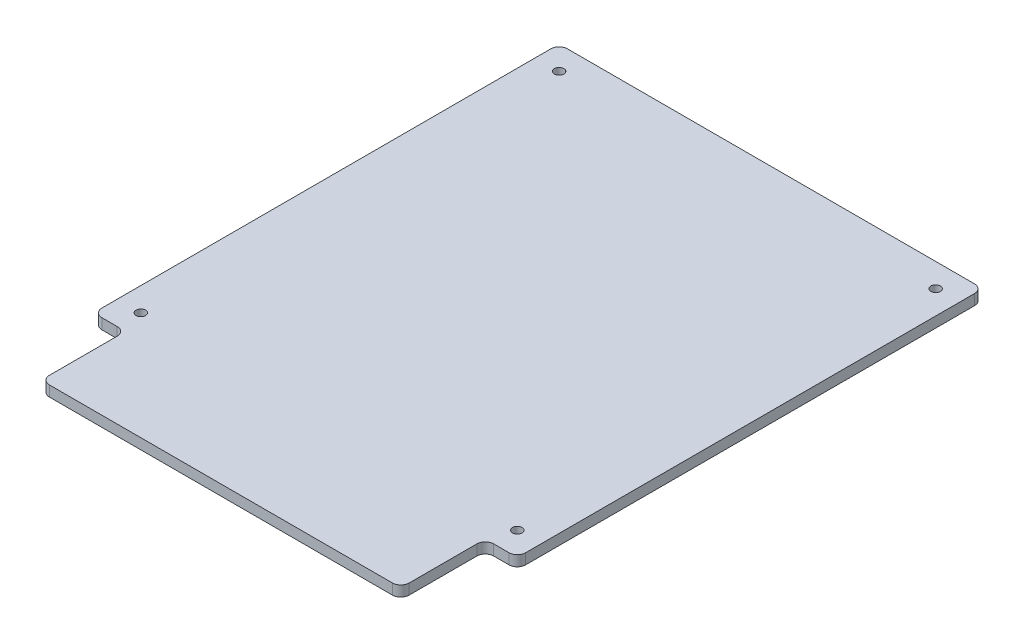
ISO-10303-21;
HEADER;
FILE_DESCRIPTION(('STEP AP214'),'2;1');
FILE_NAME('part.step','',(''),(''),'','','');
FILE_SCHEMA(('AUTOMOTIVE_DESIGN { 1 0 10303 214 1 1 1 1 }'));
ENDSEC;
DATA;
#1=APPLICATION_CONTEXT('core data for automotive mechanical design processes');
#2=APPLICATION_PROTOCOL_DEFINITION('international standard','automotive_design',2000,#1);
#3=PRODUCT_CONTEXT('',#1,'mechanical');
#4=PRODUCT('Part','Part','',(#3));
#5=PRODUCT_RELATED_PRODUCT_CATEGORY('part','',(#4));
#6=PRODUCT_DEFINITION_FORMATION('','',#4);
#7=PRODUCT_DEFINITION_CONTEXT('part definition',#1,'design');
#8=PRODUCT_DEFINITION('design','',#6,#7);
#9=PRODUCT_DEFINITION_SHAPE('','',#8);
#10=(LENGTH_UNIT() NAMED_UNIT(*) SI_UNIT(.MILLI.,.METRE.));
#11=(NAMED_UNIT(*) PLANE_ANGLE_UNIT() SI_UNIT($,.RADIAN.));
#12=(NAMED_UNIT(*) SI_UNIT($,.STERADIAN.) SOLID_ANGLE_UNIT());
#13=UNCERTAINTY_MEASURE_WITH_UNIT(LENGTH_MEASURE(1.E-05),#10,'distance_accuracy_value','');
#14=(GEOMETRIC_REPRESENTATION_CONTEXT(3) GLOBAL_UNCERTAINTY_ASSIGNED_CONTEXT((#13)) GLOBAL_UNIT_ASSIGNED_CONTEXT((#10,
#11,#12)) REPRESENTATION_CONTEXT('',''));
#15=CARTESIAN_POINT('',(0.,0.,0.));
#16=DIRECTION('',(0.,0.,1.));
#17=DIRECTION('',(1.,0.,0.));
#18=AXIS2_PLACEMENT_3D('',#15,#16,#17);
#19=CARTESIAN_POINT('',(0.,-9.525,-10.9073024484276));
#20=DIRECTION('',(0.,0.,-1.));
#21=DIRECTION('',(-1.,0.,0.));
#22=AXIS2_PLACEMENT_3D('',#19,#20,#21);
#23=PLANE('',#22);
#24=DIRECTION('',(-1.,0.,0.));
#25=VECTOR('',#24,1.);
#26=CARTESIAN_POINT('',(0.,-7.925,-10.9073024484276));
#27=LINE('',#26,#25);
#28=CARTESIAN_POINT('',(30.8971024484277,-7.925,-10.9073024484276));
#29=VERTEX_POINT('',#28);
#30=CARTESIAN_POINT('',(-30.8971024484276,-7.925,-10.9073024484276));
#31=VERTEX_POINT('',#30);
#32=EDGE_CURVE('E11',#29,#31,#27,.T.);
#33=ORIENTED_EDGE('',*,*,#32,.F.);
#34=DIRECTION('',(0.,1.,0.));
#35=VECTOR('',#34,1.);
#36=CARTESIAN_POINT('',(30.8971024484277,-9.525,-10.9073024484276));
#37=LINE('',#36,#35);
#38=CARTESIAN_POINT('',(30.8971024484277,-9.525,-10.9073024484276));
#39=VERTEX_POINT('',#38);
#40=EDGE_CURVE('E52',#39,#29,#37,.T.);
#41=ORIENTED_EDGE('',*,*,#40,.F.);
#42=DIRECTION('',(-1.,0.,0.));
#43=VECTOR('',#42,1.);
#44=CARTESIAN_POINT('',(0.,-9.525,-10.9073024484276));
#45=LINE('',#44,#43);
#46=CARTESIAN_POINT('',(-30.8971024484276,-9.525,-10.9073024484276));
#47=VERTEX_POINT('',#46);
#48=EDGE_CURVE('E296',#39,#47,#45,.T.);
#49=ORIENTED_EDGE('',*,*,#48,.T.);
#50=DIRECTION('',(0.,1.,0.));
#51=VECTOR('',#50,1.);
#52=CARTESIAN_POINT('',(-30.8971024484276,-9.525,-10.9073024484276));
#53=LINE('',#52,#51);
#54=EDGE_CURVE('E169',#47,#31,#53,.T.);
#55=ORIENTED_EDGE('',*,*,#54,.T.);
#56=EDGE_LOOP('',(#33,#41,#49,#55));
#57=FACE_BOUND('',#56,.T.);
#58=ADVANCED_FACE('F45',(#57),#23,.T.);
#59=CARTESIAN_POINT('',(30.8971024484277,-9.525,-9.63730244842763));
#60=DIRECTION('',(0.,1.,0.));
#61=DIRECTION('',(0.,0.,1.));
#62=AXIS2_PLACEMENT_3D('',#59,#60,#61);
#63=CYLINDRICAL_SURFACE('',#62,1.27000000000002);
#64=CARTESIAN_POINT('',(30.8971024484277,-7.925,-9.63730244842763));
#65=DIRECTION('',(0.,-1.,0.));
#66=DIRECTION('',(0.,0.,-1.));
#67=AXIS2_PLACEMENT_3D('',#64,#65,#66);
#68=CIRCLE('',#67,1.27000000000002);
#69=CARTESIAN_POINT('',(32.1671024484277,-7.925,-9.63730244842763));
#70=VERTEX_POINT('',#69);
#71=EDGE_CURVE('E293',#29,#70,#68,.T.);
#72=ORIENTED_EDGE('',*,*,#71,.T.);
#73=DIRECTION('',(0.,1.,0.));
#74=VECTOR('',#73,1.);
#75=CARTESIAN_POINT('',(32.1671024484277,-9.525,-9.63730244842763));
#76=LINE('',#75,#74);
#77=CARTESIAN_POINT('',(32.1671024484277,-9.525,-9.63730244842763));
#78=VERTEX_POINT('',#77);
#79=EDGE_CURVE('E290',#78,#70,#76,.T.);
#80=ORIENTED_EDGE('',*,*,#79,.F.);
#81=CARTESIAN_POINT('',(30.8971024484277,-9.525,-9.63730244842763));
#82=DIRECTION('',(0.,-1.,0.));
#83=DIRECTION('',(0.,0.,-1.));
#84=AXIS2_PLACEMENT_3D('',#81,#82,#83);
#85=CIRCLE('',#84,1.27000000000002);
#86=EDGE_CURVE('E287',#39,#78,#85,.T.);
#87=ORIENTED_EDGE('',*,*,#86,.F.);
#88=ORIENTED_EDGE('',*,*,#40,.T.);
#89=EDGE_LOOP('',(#72,#80,#87,#88));
#90=FACE_BOUND('',#89,.T.);
#91=ADVANCED_FACE('F299',(#90),#63,.T.);
#92=CARTESIAN_POINT('',(32.1671024484277,-9.525,24.4348));
#93=DIRECTION('',(1.,0.,0.));
#94=DIRECTION('',(0.,0.,-1.));
#95=AXIS2_PLACEMENT_3D('',#92,#93,#94);
#96=PLANE('',#95);
#97=DIRECTION('',(0.,0.,-1.));
#98=VECTOR('',#97,1.);
#99=CARTESIAN_POINT('',(32.1671024484277,-7.925,24.4348));
#100=LINE('',#99,#98);
#101=CARTESIAN_POINT('',(32.1671024484277,-7.925,58.5069024484277));
#102=VERTEX_POINT('',#101);
#103=EDGE_CURVE('E284',#102,#70,#100,.T.);
#104=ORIENTED_EDGE('',*,*,#103,.F.);
#105=DIRECTION('',(0.,1.,0.));
#106=VECTOR('',#105,1.);
#107=CARTESIAN_POINT('',(32.1671024484277,-9.525,58.5069024484277));
#108=LINE('',#107,#106);
#109=CARTESIAN_POINT('',(32.1671024484277,-9.525,58.5069024484277));
#110=VERTEX_POINT('',#109);
#111=EDGE_CURVE('E281',#110,#102,#108,.T.);
#112=ORIENTED_EDGE('',*,*,#111,.F.);
#113=DIRECTION('',(0.,0.,-1.));
#114=VECTOR('',#113,1.);
#115=CARTESIAN_POINT('',(32.1671024484277,-9.525,24.4348));
#116=LINE('',#115,#114);
#117=EDGE_CURVE('E278',#110,#78,#116,.T.);
#118=ORIENTED_EDGE('',*,*,#117,.T.);
#119=ORIENTED_EDGE('',*,*,#79,.T.);
#120=EDGE_LOOP('',(#104,#112,#118,#119));
#121=FACE_BOUND('',#120,.T.);
#122=ADVANCED_FACE('F304',(#121),#96,.T.);
#123=CARTESIAN_POINT('',(30.8971024484277,-9.525,58.5069024484277));
#124=DIRECTION('',(0.,1.,0.));
#125=DIRECTION('',(0.,0.,1.));
#126=AXIS2_PLACEMENT_3D('',#123,#124,#125);
#127=CYLINDRICAL_SURFACE('',#126,1.27);
#128=CARTESIAN_POINT('',(30.8971024484277,-7.925,58.5069024484277));
#129=DIRECTION('',(0.,-1.,0.));
#130=DIRECTION('',(0.,0.,-1.));
#131=AXIS2_PLACEMENT_3D('',#128,#129,#130);
#132=CIRCLE('',#131,1.27);
#133=CARTESIAN_POINT('',(30.8971024484277,-7.925,59.7769024484277));
#134=VERTEX_POINT('',#133);
#135=EDGE_CURVE('E276',#102,#134,#132,.T.);
#136=ORIENTED_EDGE('',*,*,#135,.T.);
#137=DIRECTION('',(0.,1.,0.));
#138=VECTOR('',#137,1.);
#139=CARTESIAN_POINT('',(30.8971024484277,-9.525,59.7769024484277));
#140=LINE('',#139,#138);
#141=CARTESIAN_POINT('',(30.8971024484277,-9.525,59.7769024484277));
#142=VERTEX_POINT('',#141);
#143=EDGE_CURVE('E273',#142,#134,#140,.T.);
#144=ORIENTED_EDGE('',*,*,#143,.F.);
#145=CARTESIAN_POINT('',(30.8971024484277,-9.525,58.5069024484277));
#146=DIRECTION('',(0.,-1.,0.));
#147=DIRECTION('',(0.,0.,-1.));
#148=AXIS2_PLACEMENT_3D('',#145,#146,#147);
#149=CIRCLE('',#148,1.27);
#150=EDGE_CURVE('E270',#110,#142,#149,.T.);
#151=ORIENTED_EDGE('',*,*,#150,.F.);
#152=ORIENTED_EDGE('',*,*,#111,.T.);
#153=EDGE_LOOP('',(#136,#144,#151,#152));
#154=FACE_BOUND('',#153,.T.);
#155=ADVANCED_FACE('F307',(#154),#127,.T.);
#156=CARTESIAN_POINT('',(29.7360512242138,-9.525,59.7769024484277));
#157=DIRECTION('',(0.,0.,1.));
#158=DIRECTION('',(1.,0.,0.));
#159=AXIS2_PLACEMENT_3D('',#156,#157,#158);
#160=PLANE('',#159);
#161=DIRECTION('',(1.,0.,0.));
#162=VECTOR('',#161,1.);
#163=CARTESIAN_POINT('',(29.7360512242138,-7.925,59.7769024484277));
#164=LINE('',#163,#162);
#165=CARTESIAN_POINT('',(28.575,-7.925,59.7769024484277));
#166=VERTEX_POINT('',#165);
#167=EDGE_CURVE('E267',#166,#134,#164,.T.);
#168=ORIENTED_EDGE('',*,*,#167,.F.);
#169=DIRECTION('',(0.,1.,0.));
#170=VECTOR('',#169,1.);
#171=CARTESIAN_POINT('',(28.575,-9.525,59.7769024484277));
#172=LINE('',#171,#170);
#173=CARTESIAN_POINT('',(28.575,-9.525,59.7769024484277));
#174=VERTEX_POINT('',#173);
#175=EDGE_CURVE('E264',#174,#166,#172,.T.);
#176=ORIENTED_EDGE('',*,*,#175,.F.);
#177=DIRECTION('',(1.,0.,0.));
#178=VECTOR('',#177,1.);
#179=CARTESIAN_POINT('',(29.7360512242138,-9.525,59.7769024484277));
#180=LINE('',#179,#178);
#181=EDGE_CURVE('E261',#174,#142,#180,.T.);
#182=ORIENTED_EDGE('',*,*,#181,.T.);
#183=ORIENTED_EDGE('',*,*,#143,.T.);
#184=EDGE_LOOP('',(#168,#176,#182,#183));
#185=FACE_BOUND('',#184,.T.);
#186=ADVANCED_FACE('F358',(#185),#160,.T.);
#187=CARTESIAN_POINT('',(28.575,-9.525,61.0469024484277));
#188=DIRECTION('',(0.,1.,0.));
#189=DIRECTION('',(0.,0.,1.));
#190=AXIS2_PLACEMENT_3D('',#187,#188,#189);
#191=CYLINDRICAL_SURFACE('',#190,1.27);
#192=CARTESIAN_POINT('',(28.575,-7.925,61.0469024484277));
#193=DIRECTION('',(0.,-1.,0.));
#194=DIRECTION('',(0.,0.,-1.));
#195=AXIS2_PLACEMENT_3D('',#192,#193,#194);
#196=CIRCLE('',#195,1.27);
#197=CARTESIAN_POINT('',(27.305,-7.925,61.0469024484277));
#198=VERTEX_POINT('',#197);
#199=EDGE_CURVE('E258',#198,#166,#196,.T.);
#200=ORIENTED_EDGE('',*,*,#199,.F.);
#201=DIRECTION('',(0.,1.,0.));
#202=VECTOR('',#201,1.);
#203=CARTESIAN_POINT('',(27.305,-9.525,61.0469024484277));
#204=LINE('',#203,#202);
#205=CARTESIAN_POINT('',(27.305,-9.525,61.0469024484277));
#206=VERTEX_POINT('',#205);
#207=EDGE_CURVE('E255',#206,#198,#204,.T.);
#208=ORIENTED_EDGE('',*,*,#207,.F.);
#209=CARTESIAN_POINT('',(28.575,-9.525,61.0469024484277));
#210=DIRECTION('',(0.,-1.,0.));
#211=DIRECTION('',(0.,0.,-1.));
#212=AXIS2_PLACEMENT_3D('',#209,#210,#211);
#213=CIRCLE('',#212,1.27);
#214=EDGE_CURVE('E252',#206,#174,#213,.T.);
#215=ORIENTED_EDGE('',*,*,#214,.T.);
#216=ORIENTED_EDGE('',*,*,#175,.T.);
#217=EDGE_LOOP('',(#200,#208,#215,#216));
#218=FACE_BOUND('',#217,.T.);
#219=ADVANCED_FACE('F361',(#218),#191,.F.);
#220=CARTESIAN_POINT('',(27.305,-9.525,66.1890512242138));
#221=DIRECTION('',(1.,0.,0.));
#222=DIRECTION('',(0.,0.,-1.));
#223=AXIS2_PLACEMENT_3D('',#220,#221,#222);
#224=PLANE('',#223);
#225=DIRECTION('',(0.,0.,-1.));
#226=VECTOR('',#225,1.);
#227=CARTESIAN_POINT('',(27.305,-7.925,66.1890512242138));
#228=LINE('',#227,#226);
#229=CARTESIAN_POINT('',(27.305,-7.925,71.3312));
#230=VERTEX_POINT('',#229);
#231=EDGE_CURVE('E249',#230,#198,#228,.T.);
#232=ORIENTED_EDGE('',*,*,#231,.F.);
#233=DIRECTION('',(0.,1.,0.));
#234=VECTOR('',#233,1.);
#235=CARTESIAN_POINT('',(27.305,-9.525,71.3312));
#236=LINE('',#235,#234);
#237=CARTESIAN_POINT('',(27.305,-9.525,71.3312));
#238=VERTEX_POINT('',#237);
#239=EDGE_CURVE('E246',#238,#230,#236,.T.);
#240=ORIENTED_EDGE('',*,*,#239,.F.);
#241=DIRECTION('',(0.,0.,-1.));
#242=VECTOR('',#241,1.);
#243=CARTESIAN_POINT('',(27.305,-9.525,66.1890512242138));
#244=LINE('',#243,#242);
#245=EDGE_CURVE('E243',#238,#206,#244,.T.);
#246=ORIENTED_EDGE('',*,*,#245,.T.);
#247=ORIENTED_EDGE('',*,*,#207,.T.);
#248=EDGE_LOOP('',(#232,#240,#246,#247));
#249=FACE_BOUND('',#248,.T.);
#250=ADVANCED_FACE('F365',(#249),#224,.T.);
#251=CARTESIAN_POINT('',(26.035,-9.525,71.3312));
#252=DIRECTION('',(0.,1.,0.));
#253=DIRECTION('',(0.,0.,1.));
#254=AXIS2_PLACEMENT_3D('',#251,#252,#253);
#255=CYLINDRICAL_SURFACE('',#254,1.27);
#256=CARTESIAN_POINT('',(26.035,-7.925,71.3312));
#257=DIRECTION('',(0.,-1.,0.));
#258=DIRECTION('',(0.,0.,-1.));
#259=AXIS2_PLACEMENT_3D('',#256,#257,#258);
#260=CIRCLE('',#259,1.27);
#261=CARTESIAN_POINT('',(26.035,-7.925,72.6012));
#262=VERTEX_POINT('',#261);
#263=EDGE_CURVE('E241',#230,#262,#260,.T.);
#264=ORIENTED_EDGE('',*,*,#263,.T.);
#265=DIRECTION('',(0.,1.,0.));
#266=VECTOR('',#265,1.);
#267=CARTESIAN_POINT('',(26.035,-9.525,72.6012));
#268=LINE('',#267,#266);
#269=CARTESIAN_POINT('',(26.035,-9.525,72.6012));
#270=VERTEX_POINT('',#269);
#271=EDGE_CURVE('E238',#270,#262,#268,.T.);
#272=ORIENTED_EDGE('',*,*,#271,.F.);
#273=CARTESIAN_POINT('',(26.035,-9.525,71.3312));
#274=DIRECTION('',(0.,-1.,0.));
#275=DIRECTION('',(0.,0.,-1.));
#276=AXIS2_PLACEMENT_3D('',#273,#274,#275);
#277=CIRCLE('',#276,1.27);
#278=EDGE_CURVE('E235',#238,#270,#277,.T.);
#279=ORIENTED_EDGE('',*,*,#278,.F.);
#280=ORIENTED_EDGE('',*,*,#239,.T.);
#281=EDGE_LOOP('',(#264,#272,#279,#280));
#282=FACE_BOUND('',#281,.T.);
#283=ADVANCED_FACE('F369',(#282),#255,.T.);
#284=CARTESIAN_POINT('',(0.,-9.525,72.6012));
#285=DIRECTION('',(0.,0.,1.));
#286=DIRECTION('',(1.,0.,0.));
#287=AXIS2_PLACEMENT_3D('',#284,#285,#286);
#288=PLANE('',#287);
#289=DIRECTION('',(1.,0.,0.));
#290=VECTOR('',#289,1.);
#291=CARTESIAN_POINT('',(0.,-7.925,72.6012));
#292=LINE('',#291,#290);
#293=CARTESIAN_POINT('',(-26.035,-7.925,72.6012));
#294=VERTEX_POINT('',#293);
#295=EDGE_CURVE('E232',#294,#262,#292,.T.);
#296=ORIENTED_EDGE('',*,*,#295,.F.);
#297=DIRECTION('',(0.,1.,0.));
#298=VECTOR('',#297,1.);
#299=CARTESIAN_POINT('',(-26.035,-9.525,72.6012));
#300=LINE('',#299,#298);
#301=CARTESIAN_POINT('',(-26.035,-9.525,72.6012));
#302=VERTEX_POINT('',#301);
#303=EDGE_CURVE('E229',#302,#294,#300,.T.);
#304=ORIENTED_EDGE('',*,*,#303,.F.);
#305=DIRECTION('',(1.,0.,0.));
#306=VECTOR('',#305,1.);
#307=CARTESIAN_POINT('',(0.,-9.525,72.6012));
#308=LINE('',#307,#306);
#309=EDGE_CURVE('E226',#302,#270,#308,.T.);
#310=ORIENTED_EDGE('',*,*,#309,.T.);
#311=ORIENTED_EDGE('',*,*,#271,.T.);
#312=EDGE_LOOP('',(#296,#304,#310,#311));
#313=FACE_BOUND('',#312,.T.);
#314=ADVANCED_FACE('F373',(#313),#288,.T.);
#315=CARTESIAN_POINT('',(-26.035,-9.525,71.3312));
#316=DIRECTION('',(0.,1.,0.));
#317=DIRECTION('',(0.,0.,1.));
#318=AXIS2_PLACEMENT_3D('',#315,#316,#317);
#319=CYLINDRICAL_SURFACE('',#318,1.27);
#320=CARTESIAN_POINT('',(-26.035,-7.925,71.3312));
#321=DIRECTION('',(0.,-1.,0.));
#322=DIRECTION('',(0.,0.,-1.));
#323=AXIS2_PLACEMENT_3D('',#320,#321,#322);
#324=CIRCLE('',#323,1.27);
#325=CARTESIAN_POINT('',(-27.305,-7.925,71.3312));
#326=VERTEX_POINT('',#325);
#327=EDGE_CURVE('E224',#294,#326,#324,.T.);
#328=ORIENTED_EDGE('',*,*,#327,.T.);
#329=DIRECTION('',(0.,1.,0.));
#330=VECTOR('',#329,1.);
#331=CARTESIAN_POINT('',(-27.305,-9.525,71.3312));
#332=LINE('',#331,#330);
#333=CARTESIAN_POINT('',(-27.305,-9.525,71.3312));
#334=VERTEX_POINT('',#333);
#335=EDGE_CURVE('E221',#334,#326,#332,.T.);
#336=ORIENTED_EDGE('',*,*,#335,.F.);
#337=CARTESIAN_POINT('',(-26.035,-9.525,71.3312));
#338=DIRECTION('',(0.,-1.,0.));
#339=DIRECTION('',(0.,0.,-1.));
#340=AXIS2_PLACEMENT_3D('',#337,#338,#339);
#341=CIRCLE('',#340,1.27);
#342=EDGE_CURVE('E218',#302,#334,#341,.T.);
#343=ORIENTED_EDGE('',*,*,#342,.F.);
#344=ORIENTED_EDGE('',*,*,#303,.T.);
#345=EDGE_LOOP('',(#328,#336,#343,#344));
#346=FACE_BOUND('',#345,.T.);
#347=ADVANCED_FACE('F377',(#346),#319,.T.);
#348=CARTESIAN_POINT('',(-27.305,-9.525,66.1890512242138));
#349=DIRECTION('',(-1.,0.,0.));
#350=DIRECTION('',(0.,0.,1.));
#351=AXIS2_PLACEMENT_3D('',#348,#349,#350);
#352=PLANE('',#351);
#353=DIRECTION('',(0.,0.,1.));
#354=VECTOR('',#353,1.);
#355=CARTESIAN_POINT('',(-27.305,-7.925,66.1890512242138));
#356=LINE('',#355,#354);
#357=CARTESIAN_POINT('',(-27.305,-7.925,61.0469024484277));
#358=VERTEX_POINT('',#357);
#359=EDGE_CURVE('E215',#358,#326,#356,.T.);
#360=ORIENTED_EDGE('',*,*,#359,.F.);
#361=DIRECTION('',(0.,1.,0.));
#362=VECTOR('',#361,1.);
#363=CARTESIAN_POINT('',(-27.305,-9.525,61.0469024484277));
#364=LINE('',#363,#362);
#365=CARTESIAN_POINT('',(-27.305,-9.525,61.0469024484277));
#366=VERTEX_POINT('',#365);
#367=EDGE_CURVE('E212',#366,#358,#364,.T.);
#368=ORIENTED_EDGE('',*,*,#367,.F.);
#369=DIRECTION('',(0.,0.,1.));
#370=VECTOR('',#369,1.);
#371=CARTESIAN_POINT('',(-27.305,-9.525,66.1890512242138));
#372=LINE('',#371,#370);
#373=EDGE_CURVE('E209',#366,#334,#372,.T.);
#374=ORIENTED_EDGE('',*,*,#373,.T.);
#375=ORIENTED_EDGE('',*,*,#335,.T.);
#376=EDGE_LOOP('',(#360,#368,#374,#375));
#377=FACE_BOUND('',#376,.T.);
#378=ADVANCED_FACE('F381',(#377),#352,.T.);
#379=CARTESIAN_POINT('',(-28.575,-9.525,61.0469024484277));
#380=DIRECTION('',(0.,1.,0.));
#381=DIRECTION('',(0.,0.,1.));
#382=AXIS2_PLACEMENT_3D('',#379,#380,#381);
#383=CYLINDRICAL_SURFACE('',#382,1.27);
#384=CARTESIAN_POINT('',(-28.575,-7.925,61.0469024484277));
#385=DIRECTION('',(0.,-1.,0.));
#386=DIRECTION('',(0.,0.,-1.));
#387=AXIS2_PLACEMENT_3D('',#384,#385,#386);
#388=CIRCLE('',#387,1.27);
#389=CARTESIAN_POINT('',(-28.575,-7.925,59.7769024484277));
#390=VERTEX_POINT('',#389);
#391=EDGE_CURVE('E206',#390,#358,#388,.T.);
#392=ORIENTED_EDGE('',*,*,#391,.F.);
#393=DIRECTION('',(0.,1.,0.));
#394=VECTOR('',#393,1.);
#395=CARTESIAN_POINT('',(-28.575,-9.525,59.7769024484277));
#396=LINE('',#395,#394);
#397=CARTESIAN_POINT('',(-28.575,-9.525,59.7769024484277));
#398=VERTEX_POINT('',#397);
#399=EDGE_CURVE('E203',#398,#390,#396,.T.);
#400=ORIENTED_EDGE('',*,*,#399,.F.);
#401=CARTESIAN_POINT('',(-28.575,-9.525,61.0469024484277));
#402=DIRECTION('',(0.,-1.,0.));
#403=DIRECTION('',(0.,0.,-1.));
#404=AXIS2_PLACEMENT_3D('',#401,#402,#403);
#405=CIRCLE('',#404,1.27);
#406=EDGE_CURVE('E200',#398,#366,#405,.T.);
#407=ORIENTED_EDGE('',*,*,#406,.T.);
#408=ORIENTED_EDGE('',*,*,#367,.T.);
#409=EDGE_LOOP('',(#392,#400,#407,#408));
#410=FACE_BOUND('',#409,.T.);
#411=ADVANCED_FACE('F385',(#410),#383,.F.);
#412=CARTESIAN_POINT('',(-29.7360512242138,-9.525,59.7769024484277));
#413=DIRECTION('',(0.,0.,1.));
#414=DIRECTION('',(1.,0.,0.));
#415=AXIS2_PLACEMENT_3D('',#412,#413,#414);
#416=PLANE('',#415);
#417=DIRECTION('',(1.,0.,0.));
#418=VECTOR('',#417,1.);
#419=CARTESIAN_POINT('',(-29.7360512242138,-7.925,59.7769024484277));
#420=LINE('',#419,#418);
#421=CARTESIAN_POINT('',(-30.8971024484276,-7.925,59.7769024484277));
#422=VERTEX_POINT('',#421);
#423=EDGE_CURVE('E197',#422,#390,#420,.T.);
#424=ORIENTED_EDGE('',*,*,#423,.F.);
#425=DIRECTION('',(0.,1.,0.));
#426=VECTOR('',#425,1.);
#427=CARTESIAN_POINT('',(-30.8971024484276,-9.525,59.7769024484277));
#428=LINE('',#427,#426);
#429=CARTESIAN_POINT('',(-30.8971024484276,-9.525,59.7769024484277));
#430=VERTEX_POINT('',#429);
#431=EDGE_CURVE('E194',#430,#422,#428,.T.);
#432=ORIENTED_EDGE('',*,*,#431,.F.);
#433=DIRECTION('',(1.,0.,0.));
#434=VECTOR('',#433,1.);
#435=CARTESIAN_POINT('',(-29.7360512242138,-9.525,59.7769024484277));
#436=LINE('',#435,#434);
#437=EDGE_CURVE('E191',#430,#398,#436,.T.);
#438=ORIENTED_EDGE('',*,*,#437,.T.);
#439=ORIENTED_EDGE('',*,*,#399,.T.);
#440=EDGE_LOOP('',(#424,#432,#438,#439));
#441=FACE_BOUND('',#440,.T.);
#442=ADVANCED_FACE('F389',(#441),#416,.T.);
#443=CARTESIAN_POINT('',(-30.8971024484276,-9.525,58.5069024484277));
#444=DIRECTION('',(0.,1.,0.));
#445=DIRECTION('',(0.,0.,1.));
#446=AXIS2_PLACEMENT_3D('',#443,#444,#445);
#447=CYLINDRICAL_SURFACE('',#446,1.27000000000001);
#448=CARTESIAN_POINT('',(-30.8971024484276,-7.925,58.5069024484277));
#449=DIRECTION('',(0.,-1.,0.));
#450=DIRECTION('',(0.,0.,-1.));
#451=AXIS2_PLACEMENT_3D('',#448,#449,#450);
#452=CIRCLE('',#451,1.27000000000001);
#453=CARTESIAN_POINT('',(-32.1671024484277,-7.925,58.5069024484277));
#454=VERTEX_POINT('',#453);
#455=EDGE_CURVE('E189',#422,#454,#452,.T.);
#456=ORIENTED_EDGE('',*,*,#455,.T.);
#457=DIRECTION('',(0.,1.,0.));
#458=VECTOR('',#457,1.);
#459=CARTESIAN_POINT('',(-32.1671024484277,-9.525,58.5069024484277));
#460=LINE('',#459,#458);
#461=CARTESIAN_POINT('',(-32.1671024484277,-9.525,58.5069024484277));
#462=VERTEX_POINT('',#461);
#463=EDGE_CURVE('E187',#462,#454,#460,.T.);
#464=ORIENTED_EDGE('',*,*,#463,.F.);
#465=CARTESIAN_POINT('',(-30.8971024484276,-9.525,58.5069024484277));
#466=DIRECTION('',(0.,-1.,0.));
#467=DIRECTION('',(0.,0.,-1.));
#468=AXIS2_PLACEMENT_3D('',#465,#466,#467);
#469=CIRCLE('',#468,1.27000000000001);
#470=EDGE_CURVE('E177',#430,#462,#469,.T.);
#471=ORIENTED_EDGE('',*,*,#470,.F.);
#472=ORIENTED_EDGE('',*,*,#431,.T.);
#473=EDGE_LOOP('',(#456,#464,#471,#472));
#474=FACE_BOUND('',#473,.T.);
#475=ADVANCED_FACE('F345',(#474),#447,.T.);
#476=CARTESIAN_POINT('',(-32.1671024484276,-9.525,24.4348));
#477=DIRECTION('',(1.,0.,0.));
#478=DIRECTION('',(0.,0.,-1.));
#479=AXIS2_PLACEMENT_3D('',#476,#477,#478);
#480=PLANE('',#479);
#481=DIRECTION('',(0.,0.,-1.));
#482=VECTOR('',#481,1.);
#483=CARTESIAN_POINT('',(-32.1671024484276,-7.925,24.4348));
#484=LINE('',#483,#482);
#485=CARTESIAN_POINT('',(-32.1671024484276,-7.925,-9.63730244842763));
#486=VERTEX_POINT('',#485);
#487=EDGE_CURVE('E160',#454,#486,#484,.T.);
#488=ORIENTED_EDGE('',*,*,#487,.T.);
#489=DIRECTION('',(0.,1.,0.));
#490=VECTOR('',#489,1.);
#491=CARTESIAN_POINT('',(-32.1671024484276,-9.525,-9.63730244842763));
#492=LINE('',#491,#490);
#493=CARTESIAN_POINT('',(-32.1671024484276,-9.525,-9.63730244842763));
#494=VERTEX_POINT('',#493);
#495=EDGE_CURVE('E152',#494,#486,#492,.T.);
#496=ORIENTED_EDGE('',*,*,#495,.F.);
#497=DIRECTION('',(0.,0.,-1.));
#498=VECTOR('',#497,1.);
#499=CARTESIAN_POINT('',(-32.1671024484276,-9.525,24.4348));
#500=LINE('',#499,#498);
#501=EDGE_CURVE('E157',#462,#494,#500,.T.);
#502=ORIENTED_EDGE('',*,*,#501,.F.);
#503=ORIENTED_EDGE('',*,*,#463,.T.);
#504=EDGE_LOOP('',(#488,#496,#502,#503));
#505=FACE_BOUND('',#504,.T.);
#506=ADVANCED_FACE('F154',(#505),#480,.F.);
#507=CARTESIAN_POINT('',(28.575,-9.525,-7.3152));
#508=DIRECTION('',(0.,1.,0.));
#509=DIRECTION('',(0.,0.,1.));
#510=AXIS2_PLACEMENT_3D('',#507,#508,#509);
#511=CYLINDRICAL_SURFACE('',#510,0.725);
#512=CARTESIAN_POINT('',(28.575,-9.525,-7.3152));
#513=DIRECTION('',(0.,-1.,0.));
#514=DIRECTION('',(0.,0.,-1.));
#515=AXIS2_PLACEMENT_3D('',#512,#513,#514);
#516=CIRCLE('',#515,0.725);
#517=CARTESIAN_POINT('',(28.575,-9.525,-8.0402));
#518=VERTEX_POINT('',#517);
#519=EDGE_CURVE('E178',#518,#518,#516,.T.);
#520=ORIENTED_EDGE('',*,*,#519,.T.);
#521=EDGE_LOOP('',(#520));
#522=FACE_BOUND('',#521,.T.);
#523=CARTESIAN_POINT('',(28.575,-7.925,-7.3152));
#524=DIRECTION('',(0.,-1.,0.));
#525=DIRECTION('',(0.,0.,-1.));
#526=AXIS2_PLACEMENT_3D('',#523,#524,#525);
#527=CIRCLE('',#526,0.725);
#528=CARTESIAN_POINT('',(28.575,-7.925,-8.0402));
#529=VERTEX_POINT('',#528);
#530=EDGE_CURVE('E181',#529,#529,#527,.T.);
#531=ORIENTED_EDGE('',*,*,#530,.F.);
#532=EDGE_LOOP('',(#531));
#533=FACE_BOUND('',#532,.T.);
#534=ADVANCED_FACE('F333',(#522,#533),#511,.F.);
#535=CARTESIAN_POINT('',(28.575,-9.525,56.1848));
#536=DIRECTION('',(0.,1.,0.));
#537=DIRECTION('',(0.,0.,1.));
#538=AXIS2_PLACEMENT_3D('',#535,#536,#537);
#539=CYLINDRICAL_SURFACE('',#538,0.725);
#540=CARTESIAN_POINT('',(28.575,-9.525,56.1848));
#541=DIRECTION('',(0.,-1.,0.));
#542=DIRECTION('',(0.,0.,-1.));
#543=AXIS2_PLACEMENT_3D('',#540,#541,#542);
#544=CIRCLE('',#543,0.725);
#545=CARTESIAN_POINT('',(28.575,-9.525,55.4598));
#546=VERTEX_POINT('',#545);
#547=EDGE_CURVE('E327',#546,#546,#544,.T.);
#548=ORIENTED_EDGE('',*,*,#547,.T.);
#549=EDGE_LOOP('',(#548));
#550=FACE_BOUND('',#549,.T.);
#551=CARTESIAN_POINT('',(28.575,-7.925,56.1848));
#552=DIRECTION('',(0.,-1.,0.));
#553=DIRECTION('',(0.,0.,-1.));
#554=AXIS2_PLACEMENT_3D('',#551,#552,#553);
#555=CIRCLE('',#554,0.725);
#556=CARTESIAN_POINT('',(28.575,-7.925,55.4598));
#557=VERTEX_POINT('',#556);
#558=EDGE_CURVE('E324',#557,#557,#555,.T.);
#559=ORIENTED_EDGE('',*,*,#558,.F.);
#560=EDGE_LOOP('',(#559));
#561=FACE_BOUND('',#560,.T.);
#562=ADVANCED_FACE('F335',(#550,#561),#539,.F.);
#563=CARTESIAN_POINT('',(-28.575,-9.525,56.1848));
#564=DIRECTION('',(0.,1.,0.));
#565=DIRECTION('',(0.,0.,1.));
#566=AXIS2_PLACEMENT_3D('',#563,#564,#565);
#567=CYLINDRICAL_SURFACE('',#566,0.725);
#568=CARTESIAN_POINT('',(-28.575,-9.525,56.1848));
#569=DIRECTION('',(0.,-1.,0.));
#570=DIRECTION('',(0.,0.,-1.));
#571=AXIS2_PLACEMENT_3D('',#568,#569,#570);
#572=CIRCLE('',#571,0.725);
#573=CARTESIAN_POINT('',(-28.575,-9.525,55.4598));
#574=VERTEX_POINT('',#573);
#575=EDGE_CURVE('E321',#574,#574,#572,.T.);
#576=ORIENTED_EDGE('',*,*,#575,.T.);
#577=EDGE_LOOP('',(#576));
#578=FACE_BOUND('',#577,.T.);
#579=CARTESIAN_POINT('',(-28.575,-7.925,56.1848));
#580=DIRECTION('',(0.,-1.,0.));
#581=DIRECTION('',(0.,0.,-1.));
#582=AXIS2_PLACEMENT_3D('',#579,#580,#581);
#583=CIRCLE('',#582,0.725);
#584=CARTESIAN_POINT('',(-28.575,-7.925,55.4598));
#585=VERTEX_POINT('',#584);
#586=EDGE_CURVE('E318',#585,#585,#583,.T.);
#587=ORIENTED_EDGE('',*,*,#586,.F.);
#588=EDGE_LOOP('',(#587));
#589=FACE_BOUND('',#588,.T.);
#590=ADVANCED_FACE('F342',(#578,#589),#567,.F.);
#591=CARTESIAN_POINT('',(-28.575,-9.525,-7.3152));
#592=DIRECTION('',(0.,1.,0.));
#593=DIRECTION('',(0.,0.,1.));
#594=AXIS2_PLACEMENT_3D('',#591,#592,#593);
#595=CYLINDRICAL_SURFACE('',#594,0.725);
#596=CARTESIAN_POINT('',(-28.575,-9.525,-7.3152));
#597=DIRECTION('',(0.,-1.,0.));
#598=DIRECTION('',(0.,0.,-1.));
#599=AXIS2_PLACEMENT_3D('',#596,#597,#598);
#600=CIRCLE('',#599,0.725);
#601=CARTESIAN_POINT('',(-28.575,-9.525,-8.0402));
#602=VERTEX_POINT('',#601);
#603=EDGE_CURVE('E313',#602,#602,#600,.T.);
#604=ORIENTED_EDGE('',*,*,#603,.T.);
#605=EDGE_LOOP('',(#604));
#606=FACE_BOUND('',#605,.T.);
#607=CARTESIAN_POINT('',(-28.575,-7.925,-7.3152));
#608=DIRECTION('',(0.,-1.,0.));
#609=DIRECTION('',(0.,0.,-1.));
#610=AXIS2_PLACEMENT_3D('',#607,#608,#609);
#611=CIRCLE('',#610,0.725);
#612=CARTESIAN_POINT('',(-28.575,-7.925,-8.0402));
#613=VERTEX_POINT('',#612);
#614=EDGE_CURVE('E310',#613,#613,#611,.T.);
#615=ORIENTED_EDGE('',*,*,#614,.F.);
#616=EDGE_LOOP('',(#615));
#617=FACE_BOUND('',#616,.T.);
#618=ADVANCED_FACE('F438',(#606,#617),#595,.F.);
#619=CARTESIAN_POINT('',(-30.8971024484276,-9.525,-9.63730244842763));
#620=DIRECTION('',(0.,1.,0.));
#621=DIRECTION('',(0.,0.,1.));
#622=AXIS2_PLACEMENT_3D('',#619,#620,#621);
#623=CYLINDRICAL_SURFACE('',#622,1.27000000000002);
#624=CARTESIAN_POINT('',(-30.8971024484276,-7.925,-9.63730244842763));
#625=DIRECTION('',(0.,-1.,0.));
#626=DIRECTION('',(0.,0.,-1.));
#627=AXIS2_PLACEMENT_3D('',#624,#625,#626);
#628=CIRCLE('',#627,1.27000000000002);
#629=EDGE_CURVE('E172',#486,#31,#628,.T.);
#630=ORIENTED_EDGE('',*,*,#629,.T.);
#631=ORIENTED_EDGE('',*,*,#54,.F.);
#632=CARTESIAN_POINT('',(-30.8971024484276,-9.525,-9.63730244842763));
#633=DIRECTION('',(0.,-1.,0.));
#634=DIRECTION('',(0.,0.,-1.));
#635=AXIS2_PLACEMENT_3D('',#632,#633,#634);
#636=CIRCLE('',#635,1.27000000000002);
#637=EDGE_CURVE('E167',#494,#47,#636,.T.);
#638=ORIENTED_EDGE('',*,*,#637,.F.);
#639=ORIENTED_EDGE('',*,*,#495,.T.);
#640=EDGE_LOOP('',(#630,#631,#638,#639));
#641=FACE_BOUND('',#640,.T.);
#642=ADVANCED_FACE('F168',(#641),#623,.T.);
#643=CARTESIAN_POINT('',(0.,-9.525,30.8469487757861));
#644=DIRECTION('',(0.,-1.,0.));
#645=DIRECTION('',(1.,0.,0.));
#646=AXIS2_PLACEMENT_3D('',#643,#644,#645);
#647=PLANE('',#646);
#648=ORIENTED_EDGE('',*,*,#603,.F.);
#649=EDGE_LOOP('',(#648));
#650=FACE_BOUND('',#649,.T.);
#651=ORIENTED_EDGE('',*,*,#575,.F.);
#652=EDGE_LOOP('',(#651));
#653=FACE_BOUND('',#652,.T.);
#654=ORIENTED_EDGE('',*,*,#547,.F.);
#655=EDGE_LOOP('',(#654));
#656=FACE_BOUND('',#655,.T.);
#657=ORIENTED_EDGE('',*,*,#519,.F.);
#658=EDGE_LOOP('',(#657));
#659=FACE_BOUND('',#658,.T.);
#660=ORIENTED_EDGE('',*,*,#48,.F.);
#661=ORIENTED_EDGE('',*,*,#86,.T.);
#662=ORIENTED_EDGE('',*,*,#117,.F.);
#663=ORIENTED_EDGE('',*,*,#150,.T.);
#664=ORIENTED_EDGE('',*,*,#181,.F.);
#665=ORIENTED_EDGE('',*,*,#214,.F.);
#666=ORIENTED_EDGE('',*,*,#245,.F.);
#667=ORIENTED_EDGE('',*,*,#278,.T.);
#668=ORIENTED_EDGE('',*,*,#309,.F.);
#669=ORIENTED_EDGE('',*,*,#342,.T.);
#670=ORIENTED_EDGE('',*,*,#373,.F.);
#671=ORIENTED_EDGE('',*,*,#406,.F.);
#672=ORIENTED_EDGE('',*,*,#437,.F.);
#673=ORIENTED_EDGE('',*,*,#470,.T.);
#674=ORIENTED_EDGE('',*,*,#501,.T.);
#675=ORIENTED_EDGE('',*,*,#637,.T.);
#676=EDGE_LOOP('',(#660,#661,#662,#663,#664,#665,#666,#667,#668,#669,#670,#671,#672,#673,#674,#675));
#677=FACE_BOUND('',#676,.T.);
#678=ADVANCED_FACE('F174',(#650,#653,#656,#659,#677),#647,.T.);
#679=CARTESIAN_POINT('',(0.,-7.925,30.8469487757861));
#680=DIRECTION('',(0.,-1.,0.));
#681=DIRECTION('',(1.,0.,0.));
#682=AXIS2_PLACEMENT_3D('',#679,#680,#681);
#683=PLANE('',#682);
#684=ORIENTED_EDGE('',*,*,#614,.T.);
#685=EDGE_LOOP('',(#684));
#686=FACE_BOUND('',#685,.T.);
#687=ORIENTED_EDGE('',*,*,#586,.T.);
#688=EDGE_LOOP('',(#687));
#689=FACE_BOUND('',#688,.T.);
#690=ORIENTED_EDGE('',*,*,#558,.T.);
#691=EDGE_LOOP('',(#690));
#692=FACE_BOUND('',#691,.T.);
#693=ORIENTED_EDGE('',*,*,#530,.T.);
#694=EDGE_LOOP('',(#693));
#695=FACE_BOUND('',#694,.T.);
#696=ORIENTED_EDGE('',*,*,#32,.T.);
#697=ORIENTED_EDGE('',*,*,#629,.F.);
#698=ORIENTED_EDGE('',*,*,#487,.F.);
#699=ORIENTED_EDGE('',*,*,#455,.F.);
#700=ORIENTED_EDGE('',*,*,#423,.T.);
#701=ORIENTED_EDGE('',*,*,#391,.T.);
#702=ORIENTED_EDGE('',*,*,#359,.T.);
#703=ORIENTED_EDGE('',*,*,#327,.F.);
#704=ORIENTED_EDGE('',*,*,#295,.T.);
#705=ORIENTED_EDGE('',*,*,#263,.F.);
#706=ORIENTED_EDGE('',*,*,#231,.T.);
#707=ORIENTED_EDGE('',*,*,#199,.T.);
#708=ORIENTED_EDGE('',*,*,#167,.T.);
#709=ORIENTED_EDGE('',*,*,#135,.F.);
#710=ORIENTED_EDGE('',*,*,#103,.T.);
#711=ORIENTED_EDGE('',*,*,#71,.F.);
#712=EDGE_LOOP('',(#696,#697,#698,#699,#700,#701,#702,#703,#704,#705,#706,#707,#708,#709,#710,#711));
#713=FACE_BOUND('',#712,.T.);
#714=ADVANCED_FACE('F301',(#686,#689,#692,#695,#713),#683,.F.);
#715=CLOSED_SHELL('',(#58,#91,#122,#155,#186,#219,#250,#283,#314,#347,#378,#411,#442,#475,#506,
#534,#562,#590,#618,#642,#678,#714));
#716=MANIFOLD_SOLID_BREP('B2',#715);
#717=ADVANCED_BREP_SHAPE_REPRESENTATION('',(#18,#716),#14);
#718=SHAPE_DEFINITION_REPRESENTATION(#9,#717);
ENDSEC;
END-ISO-10303-21;
